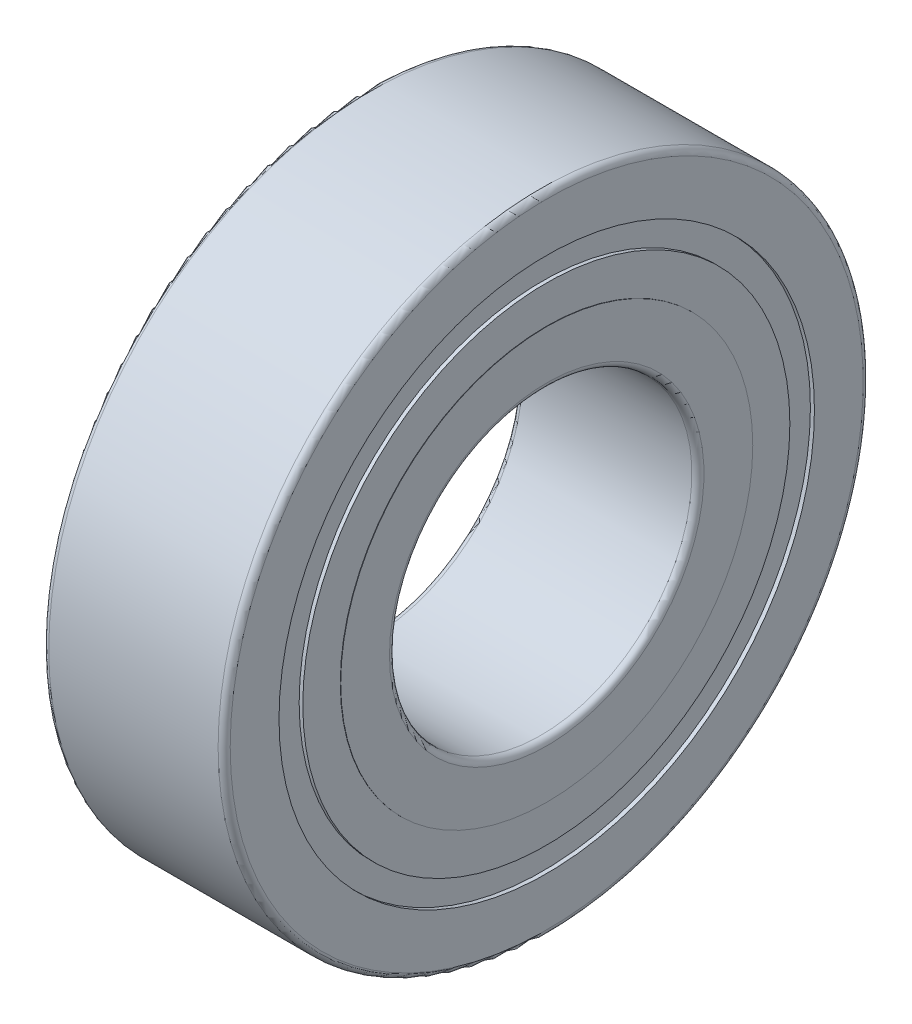
ISO-10303-21;
HEADER;
FILE_DESCRIPTION(('STEP AP214'),'2;1');
FILE_NAME('part.step','',(''),(''),'','','');
FILE_SCHEMA(('AUTOMOTIVE_DESIGN { 1 0 10303 214 1 1 1 1 }'));
ENDSEC;
DATA;
#1=APPLICATION_CONTEXT('core data for automotive mechanical design processes');
#2=APPLICATION_PROTOCOL_DEFINITION('international standard','automotive_design',2000,#1);
#3=PRODUCT_CONTEXT('',#1,'mechanical');
#4=PRODUCT('Part','Part','',(#3));
#5=PRODUCT_RELATED_PRODUCT_CATEGORY('part','',(#4));
#6=PRODUCT_DEFINITION_FORMATION('','',#4);
#7=PRODUCT_DEFINITION_CONTEXT('part definition',#1,'design');
#8=PRODUCT_DEFINITION('design','',#6,#7);
#9=PRODUCT_DEFINITION_SHAPE('','',#8);
#10=(LENGTH_UNIT() NAMED_UNIT(*) SI_UNIT(.MILLI.,.METRE.));
#11=(NAMED_UNIT(*) PLANE_ANGLE_UNIT() SI_UNIT($,.RADIAN.));
#12=(NAMED_UNIT(*) SI_UNIT($,.STERADIAN.) SOLID_ANGLE_UNIT());
#13=UNCERTAINTY_MEASURE_WITH_UNIT(LENGTH_MEASURE(1.E-05),#10,'distance_accuracy_value','');
#14=(GEOMETRIC_REPRESENTATION_CONTEXT(3) GLOBAL_UNCERTAINTY_ASSIGNED_CONTEXT((#13)) GLOBAL_UNIT_ASSIGNED_CONTEXT((#10,
#11,#12)) REPRESENTATION_CONTEXT('',''));
#15=CARTESIAN_POINT('',(0.,0.,0.));
#16=DIRECTION('',(0.,0.,1.));
#17=DIRECTION('',(1.,0.,0.));
#18=AXIS2_PLACEMENT_3D('',#15,#16,#17);
#19=CARTESIAN_POINT('',(14.4,24.96,0.));
#20=DIRECTION('',(-1.,0.,0.));
#21=DIRECTION('',(0.,0.,1.));
#22=AXIS2_PLACEMENT_3D('',#19,#20,#21);
#23=PLANE('',#22);
#24=CARTESIAN_POINT('',(14.4,0.,0.));
#25=DIRECTION('',(-1.,0.,0.));
#26=DIRECTION('',(0.,0.,1.));
#27=AXIS2_PLACEMENT_3D('',#24,#25,#26);
#28=CIRCLE('',#27,50.24);
#29=CARTESIAN_POINT('',(14.4,0.,50.24));
#30=VERTEX_POINT('',#29);
#31=EDGE_CURVE('E81',#30,#30,#28,.T.);
#32=ORIENTED_EDGE('',*,*,#31,.F.);
#33=EDGE_LOOP('',(#32));
#34=FACE_BOUND('',#33,.T.);
#35=CARTESIAN_POINT('',(14.4,0.,0.));
#36=DIRECTION('',(-1.,0.,0.));
#37=DIRECTION('',(0.,0.,1.));
#38=AXIS2_PLACEMENT_3D('',#35,#36,#37);
#39=CIRCLE('',#38,42.496);
#40=CARTESIAN_POINT('',(14.4,0.,42.496));
#41=VERTEX_POINT('',#40);
#42=EDGE_CURVE('E41',#41,#41,#39,.F.);
#43=ORIENTED_EDGE('',*,*,#42,.F.);
#44=EDGE_LOOP('',(#43));
#45=FACE_BOUND('',#44,.T.);
#46=ADVANCED_FACE('F37',(#34,#45),#23,.F.);
#47=CARTESIAN_POINT('',(14.4,0.,0.));
#48=DIRECTION('',(-1.,0.,0.));
#49=DIRECTION('',(0.,0.,1.));
#50=AXIS2_PLACEMENT_3D('',#47,#48,#49);
#51=CIRCLE('',#50,24.96);
#52=CARTESIAN_POINT('',(14.4,0.,24.96));
#53=VERTEX_POINT('',#52);
#54=EDGE_CURVE('E85',#53,#53,#51,.T.);
#55=ORIENTED_EDGE('',*,*,#54,.T.);
#56=EDGE_LOOP('',(#55));
#57=FACE_BOUND('',#56,.T.);
#58=CARTESIAN_POINT('',(14.4,0.,0.));
#59=DIRECTION('',(-1.,0.,0.));
#60=DIRECTION('',(0.,0.,1.));
#61=AXIS2_PLACEMENT_3D('',#58,#59,#60);
#62=CIRCLE('',#61,32.704);
#63=CARTESIAN_POINT('',(14.4,0.,32.704));
#64=VERTEX_POINT('',#63);
#65=EDGE_CURVE('E303',#64,#64,#62,.T.);
#66=ORIENTED_EDGE('',*,*,#65,.F.);
#67=EDGE_LOOP('',(#66));
#68=FACE_BOUND('',#67,.T.);
#69=ADVANCED_FACE('F107',(#57,#68),#23,.F.);
#70=CARTESIAN_POINT('',(-14.4,50.24,0.));
#71=DIRECTION('',(1.,0.,0.));
#72=DIRECTION('',(0.,0.,-1.));
#73=AXIS2_PLACEMENT_3D('',#70,#71,#72);
#74=PLANE('',#73);
#75=CARTESIAN_POINT('',(-14.4,0.,0.));
#76=DIRECTION('',(-1.,0.,0.));
#77=DIRECTION('',(0.,0.,1.));
#78=AXIS2_PLACEMENT_3D('',#75,#76,#77);
#79=CIRCLE('',#78,24.96);
#80=CARTESIAN_POINT('',(-14.4,0.,24.96));
#81=VERTEX_POINT('',#80);
#82=EDGE_CURVE('E46',#81,#81,#79,.T.);
#83=ORIENTED_EDGE('',*,*,#82,.F.);
#84=EDGE_LOOP('',(#83));
#85=FACE_BOUND('',#84,.T.);
#86=CARTESIAN_POINT('',(-14.4,0.,0.));
#87=DIRECTION('',(-1.,0.,0.));
#88=DIRECTION('',(0.,0.,1.));
#89=AXIS2_PLACEMENT_3D('',#86,#87,#88);
#90=CIRCLE('',#89,32.704);
#91=CARTESIAN_POINT('',(-14.4,0.,32.704));
#92=VERTEX_POINT('',#91);
#93=EDGE_CURVE('E59',#92,#92,#90,.T.);
#94=ORIENTED_EDGE('',*,*,#93,.T.);
#95=EDGE_LOOP('',(#94));
#96=FACE_BOUND('',#95,.T.);
#97=ADVANCED_FACE('F104',(#85,#96),#74,.F.);
#98=CARTESIAN_POINT('',(-14.4,0.,0.));
#99=DIRECTION('',(-1.,0.,0.));
#100=DIRECTION('',(0.,0.,1.));
#101=AXIS2_PLACEMENT_3D('',#98,#99,#100);
#102=CIRCLE('',#101,50.24);
#103=CARTESIAN_POINT('',(-14.4,0.,50.24));
#104=VERTEX_POINT('',#103);
#105=EDGE_CURVE('E10',#104,#104,#102,.T.);
#106=ORIENTED_EDGE('',*,*,#105,.T.);
#107=EDGE_LOOP('',(#106));
#108=FACE_BOUND('',#107,.T.);
#109=CARTESIAN_POINT('',(-14.4,0.,0.));
#110=DIRECTION('',(1.,0.,0.));
#111=DIRECTION('',(0.,0.,-1.));
#112=AXIS2_PLACEMENT_3D('',#109,#110,#111);
#113=CIRCLE('',#112,42.496);
#114=CARTESIAN_POINT('',(-14.4,0.,-42.496));
#115=VERTEX_POINT('',#114);
#116=EDGE_CURVE('E55',#115,#115,#113,.F.);
#117=ORIENTED_EDGE('',*,*,#116,.F.);
#118=EDGE_LOOP('',(#117));
#119=FACE_BOUND('',#118,.T.);
#120=ADVANCED_FACE('F106',(#108,#119),#74,.F.);
#121=CARTESIAN_POINT('',(-13.4400000000004,0.,0.));
#122=DIRECTION('',(-1.,0.,0.));
#123=DIRECTION('',(0.,0.,1.));
#124=AXIS2_PLACEMENT_3D('',#121,#122,#123);
#125=TOROIDAL_SURFACE('',#124,50.2400000000004,0.959999999999615);
#126=ORIENTED_EDGE('',*,*,#105,.F.);
#127=EDGE_LOOP('',(#126));
#128=FACE_BOUND('',#127,.T.);
#129=CARTESIAN_POINT('',(-13.44,0.,0.));
#130=DIRECTION('',(-1.,0.,0.));
#131=DIRECTION('',(0.,0.,1.));
#132=AXIS2_PLACEMENT_3D('',#129,#130,#131);
#133=CIRCLE('',#132,51.2);
#134=CARTESIAN_POINT('',(-13.44,0.,51.2));
#135=VERTEX_POINT('',#134);
#136=EDGE_CURVE('E58',#135,#135,#133,.T.);
#137=ORIENTED_EDGE('',*,*,#136,.T.);
#138=EDGE_LOOP('',(#137));
#139=FACE_BOUND('',#138,.T.);
#140=ADVANCED_FACE('F39',(#128,#139),#125,.T.);
#141=CARTESIAN_POINT('',(-13.4400000000004,0.,0.));
#142=DIRECTION('',(-1.,0.,0.));
#143=DIRECTION('',(0.,0.,1.));
#144=AXIS2_PLACEMENT_3D('',#141,#142,#143);
#145=TOROIDAL_SURFACE('',#144,24.9599999999996,0.959999999999614);
#146=CARTESIAN_POINT('',(-13.44,0.,0.));
#147=DIRECTION('',(-1.,0.,0.));
#148=DIRECTION('',(0.,0.,1.));
#149=AXIS2_PLACEMENT_3D('',#146,#147,#148);
#150=CIRCLE('',#149,24.);
#151=CARTESIAN_POINT('',(-13.44,0.,24.));
#152=VERTEX_POINT('',#151);
#153=EDGE_CURVE('E52',#152,#152,#150,.T.);
#154=ORIENTED_EDGE('',*,*,#153,.F.);
#155=EDGE_LOOP('',(#154));
#156=FACE_BOUND('',#155,.T.);
#157=ORIENTED_EDGE('',*,*,#82,.T.);
#158=EDGE_LOOP('',(#157));
#159=FACE_BOUND('',#158,.T.);
#160=ADVANCED_FACE('F98',(#156,#159),#145,.T.);
#161=CARTESIAN_POINT('',(160.,0.,0.));
#162=DIRECTION('',(-1.,0.,0.));
#163=DIRECTION('',(0.,0.,1.));
#164=AXIS2_PLACEMENT_3D('',#161,#162,#163);
#165=CYLINDRICAL_SURFACE('',#164,24.);
#166=CARTESIAN_POINT('',(13.44,0.,0.));
#167=DIRECTION('',(-1.,0.,0.));
#168=DIRECTION('',(0.,0.,1.));
#169=AXIS2_PLACEMENT_3D('',#166,#167,#168);
#170=CIRCLE('',#169,24.);
#171=CARTESIAN_POINT('',(13.44,0.,24.));
#172=VERTEX_POINT('',#171);
#173=EDGE_CURVE('E89',#172,#172,#170,.T.);
#174=ORIENTED_EDGE('',*,*,#173,.F.);
#175=EDGE_LOOP('',(#174));
#176=FACE_BOUND('',#175,.T.);
#177=ORIENTED_EDGE('',*,*,#153,.T.);
#178=EDGE_LOOP('',(#177));
#179=FACE_BOUND('',#178,.T.);
#180=ADVANCED_FACE('F96',(#176,#179),#165,.F.);
#181=CARTESIAN_POINT('',(13.4400000000004,0.,0.));
#182=DIRECTION('',(-1.,0.,0.));
#183=DIRECTION('',(0.,0.,1.));
#184=AXIS2_PLACEMENT_3D('',#181,#182,#183);
#185=TOROIDAL_SURFACE('',#184,24.9599999999996,0.959999999999614);
#186=ORIENTED_EDGE('',*,*,#54,.F.);
#187=EDGE_LOOP('',(#186));
#188=FACE_BOUND('',#187,.T.);
#189=ORIENTED_EDGE('',*,*,#173,.T.);
#190=EDGE_LOOP('',(#189));
#191=FACE_BOUND('',#190,.T.);
#192=ADVANCED_FACE('F124',(#188,#191),#185,.T.);
#193=CARTESIAN_POINT('',(13.4400000000004,0.,0.));
#194=DIRECTION('',(-1.,0.,0.));
#195=DIRECTION('',(0.,0.,1.));
#196=AXIS2_PLACEMENT_3D('',#193,#194,#195);
#197=TOROIDAL_SURFACE('',#196,50.2400000000004,0.959999999999615);
#198=CARTESIAN_POINT('',(13.44,0.,0.));
#199=DIRECTION('',(-1.,0.,0.));
#200=DIRECTION('',(0.,0.,1.));
#201=AXIS2_PLACEMENT_3D('',#198,#199,#200);
#202=CIRCLE('',#201,51.2);
#203=CARTESIAN_POINT('',(13.44,0.,51.2));
#204=VERTEX_POINT('',#203);
#205=EDGE_CURVE('E65',#204,#204,#202,.T.);
#206=ORIENTED_EDGE('',*,*,#205,.F.);
#207=EDGE_LOOP('',(#206));
#208=FACE_BOUND('',#207,.T.);
#209=ORIENTED_EDGE('',*,*,#31,.T.);
#210=EDGE_LOOP('',(#209));
#211=FACE_BOUND('',#210,.T.);
#212=ADVANCED_FACE('F122',(#208,#211),#197,.T.);
#213=CARTESIAN_POINT('',(160.,0.,0.));
#214=DIRECTION('',(-1.,0.,0.));
#215=DIRECTION('',(0.,0.,1.));
#216=AXIS2_PLACEMENT_3D('',#213,#214,#215);
#217=CYLINDRICAL_SURFACE('',#216,51.2);
#218=ORIENTED_EDGE('',*,*,#136,.F.);
#219=EDGE_LOOP('',(#218));
#220=FACE_BOUND('',#219,.T.);
#221=ORIENTED_EDGE('',*,*,#205,.T.);
#222=EDGE_LOOP('',(#221));
#223=FACE_BOUND('',#222,.T.);
#224=ADVANCED_FACE('F147',(#220,#223),#217,.T.);
#225=CARTESIAN_POINT('',(160.,0.,0.));
#226=DIRECTION('',(-1.,0.,0.));
#227=DIRECTION('',(0.,0.,1.));
#228=AXIS2_PLACEMENT_3D('',#225,#226,#227);
#229=CYLINDRICAL_SURFACE('',#228,42.496);
#230=CARTESIAN_POINT('',(-13.76,0.,0.));
#231=DIRECTION('',(-1.,0.,0.));
#232=DIRECTION('',(0.,0.,1.));
#233=AXIS2_PLACEMENT_3D('',#230,#231,#232);
#234=CIRCLE('',#233,42.496);
#235=CARTESIAN_POINT('',(-13.76,0.,42.496));
#236=VERTEX_POINT('',#235);
#237=EDGE_CURVE('E324',#236,#236,#234,.T.);
#238=ORIENTED_EDGE('',*,*,#237,.F.);
#239=EDGE_LOOP('',(#238));
#240=FACE_BOUND('',#239,.T.);
#241=ORIENTED_EDGE('',*,*,#116,.T.);
#242=EDGE_LOOP('',(#241));
#243=FACE_BOUND('',#242,.T.);
#244=ADVANCED_FACE('F154',(#240,#243),#229,.F.);
#245=CARTESIAN_POINT('',(160.,0.,0.));
#246=DIRECTION('',(-1.,0.,0.));
#247=DIRECTION('',(0.,0.,1.));
#248=AXIS2_PLACEMENT_3D('',#245,#246,#247);
#249=CYLINDRICAL_SURFACE('',#248,32.704);
#250=CARTESIAN_POINT('',(-14.336,0.,0.));
#251=DIRECTION('',(-1.,0.,0.));
#252=DIRECTION('',(0.,0.,1.));
#253=AXIS2_PLACEMENT_3D('',#250,#251,#252);
#254=CIRCLE('',#253,32.704);
#255=CARTESIAN_POINT('',(-14.336,0.,32.704));
#256=VERTEX_POINT('',#255);
#257=EDGE_CURVE('E68',#256,#256,#254,.T.);
#258=ORIENTED_EDGE('',*,*,#257,.T.);
#259=EDGE_LOOP('',(#258));
#260=FACE_BOUND('',#259,.T.);
#261=ORIENTED_EDGE('',*,*,#93,.F.);
#262=EDGE_LOOP('',(#261));
#263=FACE_BOUND('',#262,.T.);
#264=ADVANCED_FACE('F161',(#260,#263),#249,.T.);
#265=CARTESIAN_POINT('',(-14.336,32.704,0.));
#266=DIRECTION('',(-1.,0.,0.));
#267=DIRECTION('',(0.,0.,1.));
#268=AXIS2_PLACEMENT_3D('',#265,#266,#267);
#269=PLANE('',#268);
#270=CARTESIAN_POINT('',(-14.336,0.,0.));
#271=DIRECTION('',(-1.,0.,0.));
#272=DIRECTION('',(0.,0.,1.));
#273=AXIS2_PLACEMENT_3D('',#270,#271,#272);
#274=CIRCLE('',#273,38.656);
#275=CARTESIAN_POINT('',(-14.336,0.,38.656));
#276=VERTEX_POINT('',#275);
#277=EDGE_CURVE('E74',#276,#276,#274,.T.);
#278=ORIENTED_EDGE('',*,*,#277,.T.);
#279=EDGE_LOOP('',(#278));
#280=FACE_BOUND('',#279,.T.);
#281=ORIENTED_EDGE('',*,*,#257,.F.);
#282=EDGE_LOOP('',(#281));
#283=FACE_BOUND('',#282,.T.);
#284=ADVANCED_FACE('F169',(#280,#283),#269,.T.);
#285=CARTESIAN_POINT('',(160.,0.,0.));
#286=DIRECTION('',(-1.,0.,0.));
#287=DIRECTION('',(0.,0.,1.));
#288=AXIS2_PLACEMENT_3D('',#285,#286,#287);
#289=CYLINDRICAL_SURFACE('',#288,38.656);
#290=CARTESIAN_POINT('',(-13.76,0.,0.));
#291=DIRECTION('',(-1.,0.,0.));
#292=DIRECTION('',(0.,0.,1.));
#293=AXIS2_PLACEMENT_3D('',#290,#291,#292);
#294=CIRCLE('',#293,38.656);
#295=CARTESIAN_POINT('',(-13.76,0.,38.656));
#296=VERTEX_POINT('',#295);
#297=EDGE_CURVE('E328',#296,#296,#294,.T.);
#298=ORIENTED_EDGE('',*,*,#297,.T.);
#299=EDGE_LOOP('',(#298));
#300=FACE_BOUND('',#299,.T.);
#301=ORIENTED_EDGE('',*,*,#277,.F.);
#302=EDGE_LOOP('',(#301));
#303=FACE_BOUND('',#302,.T.);
#304=ADVANCED_FACE('F177',(#300,#303),#289,.T.);
#305=CARTESIAN_POINT('',(-13.76,38.656,0.));
#306=DIRECTION('',(-1.,0.,0.));
#307=DIRECTION('',(0.,0.,1.));
#308=AXIS2_PLACEMENT_3D('',#305,#306,#307);
#309=PLANE('',#308);
#310=ORIENTED_EDGE('',*,*,#237,.T.);
#311=EDGE_LOOP('',(#310));
#312=FACE_BOUND('',#311,.T.);
#313=ORIENTED_EDGE('',*,*,#297,.F.);
#314=EDGE_LOOP('',(#313));
#315=FACE_BOUND('',#314,.T.);
#316=ADVANCED_FACE('F185',(#312,#315),#309,.T.);
#317=CARTESIAN_POINT('',(160.,0.,0.));
#318=DIRECTION('',(-1.,0.,0.));
#319=DIRECTION('',(0.,0.,1.));
#320=AXIS2_PLACEMENT_3D('',#317,#318,#319);
#321=CYLINDRICAL_SURFACE('',#320,42.496);
#322=CARTESIAN_POINT('',(13.76,0.,0.));
#323=DIRECTION('',(-1.,0.,0.));
#324=DIRECTION('',(0.,0.,1.));
#325=AXIS2_PLACEMENT_3D('',#322,#323,#324);
#326=CIRCLE('',#325,42.496);
#327=CARTESIAN_POINT('',(13.76,0.,42.496));
#328=VERTEX_POINT('',#327);
#329=EDGE_CURVE('E320',#328,#328,#326,.T.);
#330=ORIENTED_EDGE('',*,*,#329,.T.);
#331=EDGE_LOOP('',(#330));
#332=FACE_BOUND('',#331,.T.);
#333=ORIENTED_EDGE('',*,*,#42,.T.);
#334=EDGE_LOOP('',(#333));
#335=FACE_BOUND('',#334,.T.);
#336=ADVANCED_FACE('F193',(#332,#335),#321,.F.);
#337=CARTESIAN_POINT('',(13.76,42.496,0.));
#338=DIRECTION('',(1.,0.,0.));
#339=DIRECTION('',(0.,0.,-1.));
#340=AXIS2_PLACEMENT_3D('',#337,#338,#339);
#341=PLANE('',#340);
#342=CARTESIAN_POINT('',(13.76,0.,0.));
#343=DIRECTION('',(-1.,0.,0.));
#344=DIRECTION('',(0.,0.,1.));
#345=AXIS2_PLACEMENT_3D('',#342,#343,#344);
#346=CIRCLE('',#345,38.656);
#347=CARTESIAN_POINT('',(13.76,0.,38.656));
#348=VERTEX_POINT('',#347);
#349=EDGE_CURVE('E313',#348,#348,#346,.T.);
#350=ORIENTED_EDGE('',*,*,#349,.T.);
#351=EDGE_LOOP('',(#350));
#352=FACE_BOUND('',#351,.T.);
#353=ORIENTED_EDGE('',*,*,#329,.F.);
#354=EDGE_LOOP('',(#353));
#355=FACE_BOUND('',#354,.T.);
#356=ADVANCED_FACE('F201',(#352,#355),#341,.T.);
#357=CARTESIAN_POINT('',(160.,0.,0.));
#358=DIRECTION('',(-1.,0.,0.));
#359=DIRECTION('',(0.,0.,1.));
#360=AXIS2_PLACEMENT_3D('',#357,#358,#359);
#361=CYLINDRICAL_SURFACE('',#360,38.656);
#362=CARTESIAN_POINT('',(14.336,0.,0.));
#363=DIRECTION('',(-1.,0.,0.));
#364=DIRECTION('',(0.,0.,1.));
#365=AXIS2_PLACEMENT_3D('',#362,#363,#364);
#366=CIRCLE('',#365,38.656);
#367=CARTESIAN_POINT('',(14.336,0.,38.656));
#368=VERTEX_POINT('',#367);
#369=EDGE_CURVE('E308',#368,#368,#366,.T.);
#370=ORIENTED_EDGE('',*,*,#369,.T.);
#371=EDGE_LOOP('',(#370));
#372=FACE_BOUND('',#371,.T.);
#373=ORIENTED_EDGE('',*,*,#349,.F.);
#374=EDGE_LOOP('',(#373));
#375=FACE_BOUND('',#374,.T.);
#376=ADVANCED_FACE('F209',(#372,#375),#361,.T.);
#377=CARTESIAN_POINT('',(14.336,38.656,0.));
#378=DIRECTION('',(1.,0.,0.));
#379=DIRECTION('',(0.,0.,-1.));
#380=AXIS2_PLACEMENT_3D('',#377,#378,#379);
#381=PLANE('',#380);
#382=CARTESIAN_POINT('',(14.336,0.,0.));
#383=DIRECTION('',(-1.,0.,0.));
#384=DIRECTION('',(0.,0.,1.));
#385=AXIS2_PLACEMENT_3D('',#382,#383,#384);
#386=CIRCLE('',#385,32.704);
#387=CARTESIAN_POINT('',(14.336,0.,32.704));
#388=VERTEX_POINT('',#387);
#389=EDGE_CURVE('E306',#388,#388,#386,.T.);
#390=ORIENTED_EDGE('',*,*,#389,.T.);
#391=EDGE_LOOP('',(#390));
#392=FACE_BOUND('',#391,.T.);
#393=ORIENTED_EDGE('',*,*,#369,.F.);
#394=EDGE_LOOP('',(#393));
#395=FACE_BOUND('',#394,.T.);
#396=ADVANCED_FACE('F217',(#392,#395),#381,.T.);
#397=CARTESIAN_POINT('',(160.,0.,0.));
#398=DIRECTION('',(-1.,0.,0.));
#399=DIRECTION('',(0.,0.,1.));
#400=AXIS2_PLACEMENT_3D('',#397,#398,#399);
#401=CYLINDRICAL_SURFACE('',#400,32.704);
#402=ORIENTED_EDGE('',*,*,#65,.T.);
#403=EDGE_LOOP('',(#402));
#404=FACE_BOUND('',#403,.T.);
#405=ORIENTED_EDGE('',*,*,#389,.F.);
#406=EDGE_LOOP('',(#405));
#407=FACE_BOUND('',#406,.T.);
#408=ADVANCED_FACE('F225',(#404,#407),#401,.T.);
#409=CLOSED_SHELL('',(#46,#69,#97,#120,#140,#160,#180,#192,#212,#224,#244,#264,#284,#304,#316,
#336,#356,#376,#396,#408));
#410=MANIFOLD_SOLID_BREP('B2',#409);
#411=ADVANCED_BREP_SHAPE_REPRESENTATION('',(#18,#410),#14);
#412=SHAPE_DEFINITION_REPRESENTATION(#9,#411);
ENDSEC;
END-ISO-10303-21;
